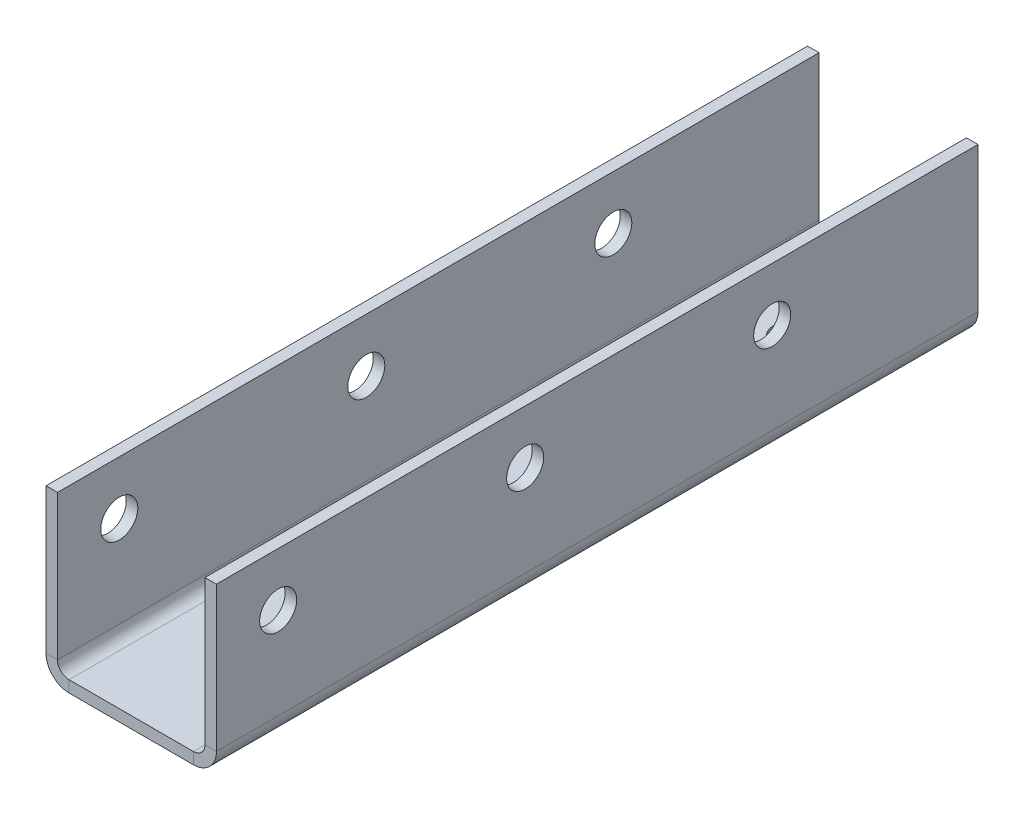
ISO-10303-21;
HEADER;
FILE_DESCRIPTION(('STEP AP214'),'2;1');
FILE_NAME('part.step','',(''),(''),'','','');
FILE_SCHEMA(('AUTOMOTIVE_DESIGN { 1 0 10303 214 1 1 1 1 }'));
ENDSEC;
DATA;
#1=APPLICATION_CONTEXT('core data for automotive mechanical design processes');
#2=APPLICATION_PROTOCOL_DEFINITION('international standard','automotive_design',2000,#1);
#3=PRODUCT_CONTEXT('',#1,'mechanical');
#4=PRODUCT('Part','Part','',(#3));
#5=PRODUCT_RELATED_PRODUCT_CATEGORY('part','',(#4));
#6=PRODUCT_DEFINITION_FORMATION('','',#4);
#7=PRODUCT_DEFINITION_CONTEXT('part definition',#1,'design');
#8=PRODUCT_DEFINITION('design','',#6,#7);
#9=PRODUCT_DEFINITION_SHAPE('','',#8);
#10=(LENGTH_UNIT() NAMED_UNIT(*) SI_UNIT(.MILLI.,.METRE.));
#11=(NAMED_UNIT(*) PLANE_ANGLE_UNIT() SI_UNIT($,.RADIAN.));
#12=(NAMED_UNIT(*) SI_UNIT($,.STERADIAN.) SOLID_ANGLE_UNIT());
#13=UNCERTAINTY_MEASURE_WITH_UNIT(LENGTH_MEASURE(1.E-05),#10,'distance_accuracy_value','');
#14=(GEOMETRIC_REPRESENTATION_CONTEXT(3) GLOBAL_UNCERTAINTY_ASSIGNED_CONTEXT((#13)) GLOBAL_UNIT_ASSIGNED_CONTEXT((#10,
#11,#12)) REPRESENTATION_CONTEXT('',''));
#15=CARTESIAN_POINT('',(0.,0.,0.));
#16=DIRECTION('',(0.,0.,1.));
#17=DIRECTION('',(1.,0.,0.));
#18=AXIS2_PLACEMENT_3D('',#15,#16,#17);
#19=CARTESIAN_POINT('',(15.1,0.,185.));
#20=DIRECTION('',(0.,0.,1.));
#21=DIRECTION('',(1.,0.,0.));
#22=AXIS2_PLACEMENT_3D('',#19,#20,#21);
#23=PLANE('',#22);
#24=DIRECTION('',(0.,1.,0.));
#25=VECTOR('',#24,1.);
#26=CARTESIAN_POINT('',(15.1,0.,185.));
#27=LINE('',#26,#25);
#28=CARTESIAN_POINT('',(15.1,0.,185.));
#29=VERTEX_POINT('',#28);
#30=CARTESIAN_POINT('',(15.1,2.80000000000001,185.));
#31=VERTEX_POINT('',#30);
#32=EDGE_CURVE('E11',#29,#31,#27,.T.);
#33=ORIENTED_EDGE('',*,*,#32,.F.);
#34=CARTESIAN_POINT('',(15.1,5.60000000000001,185.));
#35=DIRECTION('',(0.,0.,1.));
#36=DIRECTION('',(1.,0.,0.));
#37=AXIS2_PLACEMENT_3D('',#34,#35,#36);
#38=CIRCLE('',#37,5.6);
#39=CARTESIAN_POINT('',(20.7,5.60000000000001,185.));
#40=VERTEX_POINT('',#39);
#41=EDGE_CURVE('E278',#40,#29,#38,.F.);
#42=ORIENTED_EDGE('',*,*,#41,.F.);
#43=DIRECTION('',(1.,0.,0.));
#44=VECTOR('',#43,1.);
#45=CARTESIAN_POINT('',(17.9,5.60000000000001,185.));
#46=LINE('',#45,#44);
#47=CARTESIAN_POINT('',(17.9,5.60000000000001,185.));
#48=VERTEX_POINT('',#47);
#49=EDGE_CURVE('E47',#48,#40,#46,.T.);
#50=ORIENTED_EDGE('',*,*,#49,.F.);
#51=CARTESIAN_POINT('',(15.1,5.60000000000001,185.));
#52=DIRECTION('',(0.,0.,1.));
#53=DIRECTION('',(1.,0.,0.));
#54=AXIS2_PLACEMENT_3D('',#51,#52,#53);
#55=CIRCLE('',#54,2.8);
#56=EDGE_CURVE('E149',#48,#31,#55,.F.);
#57=ORIENTED_EDGE('',*,*,#56,.T.);
#58=EDGE_LOOP('',(#33,#42,#50,#57));
#59=FACE_BOUND('',#58,.T.);
#60=ADVANCED_FACE('F38',(#59),#23,.T.);
#61=CARTESIAN_POINT('',(17.9,5.60000000000001,185.));
#62=DIRECTION('',(0.,0.,1.));
#63=DIRECTION('',(1.,0.,0.));
#64=AXIS2_PLACEMENT_3D('',#61,#62,#63);
#65=PLANE('',#64);
#66=DIRECTION('',(-1.,0.,0.));
#67=VECTOR('',#66,1.);
#68=CARTESIAN_POINT('',(-20.7,0.,185.));
#69=LINE('',#68,#67);
#70=CARTESIAN_POINT('',(-15.1,0.,185.));
#71=VERTEX_POINT('',#70);
#72=EDGE_CURVE('E143',#29,#71,#69,.T.);
#73=ORIENTED_EDGE('',*,*,#72,.F.);
#74=ORIENTED_EDGE('',*,*,#32,.T.);
#75=DIRECTION('',(-1.,0.,0.));
#76=VECTOR('',#75,1.);
#77=CARTESIAN_POINT('',(-20.7,2.8,185.));
#78=LINE('',#77,#76);
#79=CARTESIAN_POINT('',(-15.1,2.8,185.));
#80=VERTEX_POINT('',#79);
#81=EDGE_CURVE('E140',#31,#80,#78,.T.);
#82=ORIENTED_EDGE('',*,*,#81,.T.);
#83=DIRECTION('',(0.,-1.,0.));
#84=VECTOR('',#83,1.);
#85=CARTESIAN_POINT('',(-15.1,2.8,185.));
#86=LINE('',#85,#84);
#87=EDGE_CURVE('E232',#80,#71,#86,.T.);
#88=ORIENTED_EDGE('',*,*,#87,.T.);
#89=EDGE_LOOP('',(#73,#74,#82,#88));
#90=FACE_BOUND('',#89,.T.);
#91=ADVANCED_FACE('F138',(#90),#65,.T.);
#92=CARTESIAN_POINT('',(20.7,5.60000000000001,0.));
#93=DIRECTION('',(0.,0.,-1.));
#94=DIRECTION('',(-1.,0.,0.));
#95=AXIS2_PLACEMENT_3D('',#92,#93,#94);
#96=PLANE('',#95);
#97=DIRECTION('',(-1.,0.,0.));
#98=VECTOR('',#97,1.);
#99=CARTESIAN_POINT('',(20.7,5.60000000000001,0.));
#100=LINE('',#99,#98);
#101=CARTESIAN_POINT('',(20.7,5.60000000000001,0.));
#102=VERTEX_POINT('',#101);
#103=CARTESIAN_POINT('',(17.9,5.60000000000001,0.));
#104=VERTEX_POINT('',#103);
#105=EDGE_CURVE('E237',#102,#104,#100,.T.);
#106=ORIENTED_EDGE('',*,*,#105,.F.);
#107=CARTESIAN_POINT('',(15.1,5.60000000000001,0.));
#108=DIRECTION('',(0.,0.,1.));
#109=DIRECTION('',(1.,0.,0.));
#110=AXIS2_PLACEMENT_3D('',#107,#108,#109);
#111=CIRCLE('',#110,5.6);
#112=CARTESIAN_POINT('',(15.1,0.,0.));
#113=VERTEX_POINT('',#112);
#114=EDGE_CURVE('E189',#102,#113,#111,.F.);
#115=ORIENTED_EDGE('',*,*,#114,.T.);
#116=DIRECTION('',(0.,-1.,0.));
#117=VECTOR('',#116,1.);
#118=CARTESIAN_POINT('',(15.1,2.80000000000001,0.));
#119=LINE('',#118,#117);
#120=CARTESIAN_POINT('',(15.1,2.80000000000001,0.));
#121=VERTEX_POINT('',#120);
#122=EDGE_CURVE('E235',#121,#113,#119,.T.);
#123=ORIENTED_EDGE('',*,*,#122,.F.);
#124=CARTESIAN_POINT('',(15.1,5.60000000000001,0.));
#125=DIRECTION('',(0.,0.,1.));
#126=DIRECTION('',(1.,0.,0.));
#127=AXIS2_PLACEMENT_3D('',#124,#125,#126);
#128=CIRCLE('',#127,2.8);
#129=EDGE_CURVE('E161',#104,#121,#128,.F.);
#130=ORIENTED_EDGE('',*,*,#129,.F.);
#131=EDGE_LOOP('',(#106,#115,#123,#130));
#132=FACE_BOUND('',#131,.T.);
#133=ADVANCED_FACE('F296',(#132),#96,.T.);
#134=CARTESIAN_POINT('',(15.1,2.80000000000001,0.));
#135=DIRECTION('',(0.,0.,-1.));
#136=DIRECTION('',(-1.,0.,0.));
#137=AXIS2_PLACEMENT_3D('',#134,#135,#136);
#138=PLANE('',#137);
#139=DIRECTION('',(0.,-1.,0.));
#140=VECTOR('',#139,1.);
#141=CARTESIAN_POINT('',(20.7,0.,0.));
#142=LINE('',#141,#140);
#143=CARTESIAN_POINT('',(20.7,40.8,0.));
#144=VERTEX_POINT('',#143);
#145=EDGE_CURVE('E192',#144,#102,#142,.T.);
#146=ORIENTED_EDGE('',*,*,#145,.T.);
#147=ORIENTED_EDGE('',*,*,#105,.T.);
#148=DIRECTION('',(0.,1.,0.));
#149=VECTOR('',#148,1.);
#150=CARTESIAN_POINT('',(17.9,0.,0.));
#151=LINE('',#150,#149);
#152=CARTESIAN_POINT('',(17.9,40.8,0.));
#153=VERTEX_POINT('',#152);
#154=EDGE_CURVE('E198',#153,#104,#151,.F.);
#155=ORIENTED_EDGE('',*,*,#154,.F.);
#156=DIRECTION('',(1.,0.,0.));
#157=VECTOR('',#156,1.);
#158=CARTESIAN_POINT('',(17.9,40.8,0.));
#159=LINE('',#158,#157);
#160=EDGE_CURVE('E195',#153,#144,#159,.T.);
#161=ORIENTED_EDGE('',*,*,#160,.T.);
#162=EDGE_LOOP('',(#146,#147,#155,#161));
#163=FACE_BOUND('',#162,.T.);
#164=ADVANCED_FACE('F344',(#163),#138,.T.);
#165=CARTESIAN_POINT('',(-20.7,5.6,185.));
#166=DIRECTION('',(0.,0.,1.));
#167=DIRECTION('',(1.,0.,0.));
#168=AXIS2_PLACEMENT_3D('',#165,#166,#167);
#169=PLANE('',#168);
#170=DIRECTION('',(1.,0.,0.));
#171=VECTOR('',#170,1.);
#172=CARTESIAN_POINT('',(-20.7,5.6,185.));
#173=LINE('',#172,#171);
#174=CARTESIAN_POINT('',(-20.7,5.6,185.));
#175=VERTEX_POINT('',#174);
#176=CARTESIAN_POINT('',(-17.9,5.6,185.));
#177=VERTEX_POINT('',#176);
#178=EDGE_CURVE('E56',#175,#177,#173,.T.);
#179=ORIENTED_EDGE('',*,*,#178,.F.);
#180=CARTESIAN_POINT('',(-15.1,5.6,185.));
#181=DIRECTION('',(0.,0.,1.));
#182=DIRECTION('',(1.,0.,0.));
#183=AXIS2_PLACEMENT_3D('',#180,#181,#182);
#184=CIRCLE('',#183,5.6);
#185=EDGE_CURVE('E274',#71,#175,#184,.F.);
#186=ORIENTED_EDGE('',*,*,#185,.F.);
#187=ORIENTED_EDGE('',*,*,#87,.F.);
#188=CARTESIAN_POINT('',(-15.1,5.6,185.));
#189=DIRECTION('',(0.,0.,1.));
#190=DIRECTION('',(1.,0.,0.));
#191=AXIS2_PLACEMENT_3D('',#188,#189,#190);
#192=CIRCLE('',#191,2.8);
#193=EDGE_CURVE('E169',#80,#177,#192,.F.);
#194=ORIENTED_EDGE('',*,*,#193,.T.);
#195=EDGE_LOOP('',(#179,#186,#187,#194));
#196=FACE_BOUND('',#195,.T.);
#197=ADVANCED_FACE('F349',(#196),#169,.T.);
#198=CARTESIAN_POINT('',(-15.1,2.8,185.));
#199=DIRECTION('',(0.,0.,1.));
#200=DIRECTION('',(1.,0.,0.));
#201=AXIS2_PLACEMENT_3D('',#198,#199,#200);
#202=PLANE('',#201);
#203=DIRECTION('',(0.,1.,0.));
#204=VECTOR('',#203,1.);
#205=CARTESIAN_POINT('',(-20.7,0.,185.));
#206=LINE('',#205,#204);
#207=CARTESIAN_POINT('',(-20.7,40.8,185.));
#208=VERTEX_POINT('',#207);
#209=EDGE_CURVE('E271',#175,#208,#206,.T.);
#210=ORIENTED_EDGE('',*,*,#209,.F.);
#211=ORIENTED_EDGE('',*,*,#178,.T.);
#212=DIRECTION('',(0.,1.,0.));
#213=VECTOR('',#212,1.);
#214=CARTESIAN_POINT('',(-17.9,0.,185.));
#215=LINE('',#214,#213);
#216=CARTESIAN_POINT('',(-17.9,40.8,185.));
#217=VERTEX_POINT('',#216);
#218=EDGE_CURVE('E110',#177,#217,#215,.T.);
#219=ORIENTED_EDGE('',*,*,#218,.T.);
#220=DIRECTION('',(1.,0.,0.));
#221=VECTOR('',#220,1.);
#222=CARTESIAN_POINT('',(-20.7,40.8,185.));
#223=LINE('',#222,#221);
#224=EDGE_CURVE('E268',#208,#217,#223,.T.);
#225=ORIENTED_EDGE('',*,*,#224,.F.);
#226=EDGE_LOOP('',(#210,#211,#219,#225));
#227=FACE_BOUND('',#226,.T.);
#228=ADVANCED_FACE('F323',(#227),#202,.T.);
#229=CARTESIAN_POINT('',(-15.1,0.,0.));
#230=DIRECTION('',(0.,0.,-1.));
#231=DIRECTION('',(-1.,0.,0.));
#232=AXIS2_PLACEMENT_3D('',#229,#230,#231);
#233=PLANE('',#232);
#234=DIRECTION('',(0.,1.,0.));
#235=VECTOR('',#234,1.);
#236=CARTESIAN_POINT('',(-15.1,0.,0.));
#237=LINE('',#236,#235);
#238=CARTESIAN_POINT('',(-15.1,0.,0.));
#239=VERTEX_POINT('',#238);
#240=CARTESIAN_POINT('',(-15.1,2.8,0.));
#241=VERTEX_POINT('',#240);
#242=EDGE_CURVE('E97',#239,#241,#237,.T.);
#243=ORIENTED_EDGE('',*,*,#242,.F.);
#244=CARTESIAN_POINT('',(-15.1,5.6,0.));
#245=DIRECTION('',(0.,0.,1.));
#246=DIRECTION('',(1.,0.,0.));
#247=AXIS2_PLACEMENT_3D('',#244,#245,#246);
#248=CIRCLE('',#247,5.6);
#249=CARTESIAN_POINT('',(-20.7,5.6,0.));
#250=VERTEX_POINT('',#249);
#251=EDGE_CURVE('E185',#239,#250,#248,.F.);
#252=ORIENTED_EDGE('',*,*,#251,.T.);
#253=DIRECTION('',(-1.,0.,0.));
#254=VECTOR('',#253,1.);
#255=CARTESIAN_POINT('',(-17.9,5.6,0.));
#256=LINE('',#255,#254);
#257=CARTESIAN_POINT('',(-17.9,5.6,0.));
#258=VERTEX_POINT('',#257);
#259=EDGE_CURVE('E104',#258,#250,#256,.T.);
#260=ORIENTED_EDGE('',*,*,#259,.F.);
#261=CARTESIAN_POINT('',(-15.1,5.6,0.));
#262=DIRECTION('',(0.,0.,1.));
#263=DIRECTION('',(1.,0.,0.));
#264=AXIS2_PLACEMENT_3D('',#261,#262,#263);
#265=CIRCLE('',#264,2.8);
#266=EDGE_CURVE('E204',#241,#258,#265,.F.);
#267=ORIENTED_EDGE('',*,*,#266,.F.);
#268=EDGE_LOOP('',(#243,#252,#260,#267));
#269=FACE_BOUND('',#268,.T.);
#270=ADVANCED_FACE('F311',(#269),#233,.T.);
#271=CARTESIAN_POINT('',(-17.9,5.6,0.));
#272=DIRECTION('',(0.,0.,-1.));
#273=DIRECTION('',(-1.,0.,0.));
#274=AXIS2_PLACEMENT_3D('',#271,#272,#273);
#275=PLANE('',#274);
#276=DIRECTION('',(-1.,0.,0.));
#277=VECTOR('',#276,1.);
#278=CARTESIAN_POINT('',(-20.7,0.,0.));
#279=LINE('',#278,#277);
#280=EDGE_CURVE('E187',#113,#239,#279,.T.);
#281=ORIENTED_EDGE('',*,*,#280,.T.);
#282=ORIENTED_EDGE('',*,*,#242,.T.);
#283=DIRECTION('',(-1.,0.,0.));
#284=VECTOR('',#283,1.);
#285=CARTESIAN_POINT('',(-20.7,2.8,0.));
#286=LINE('',#285,#284);
#287=EDGE_CURVE('E202',#121,#241,#286,.T.);
#288=ORIENTED_EDGE('',*,*,#287,.F.);
#289=ORIENTED_EDGE('',*,*,#122,.T.);
#290=EDGE_LOOP('',(#281,#282,#288,#289));
#291=FACE_BOUND('',#290,.T.);
#292=ADVANCED_FACE('F298',(#291),#275,.T.);
#293=CARTESIAN_POINT('',(-17.9,0.,185.));
#294=DIRECTION('',(-1.,0.,0.));
#295=DIRECTION('',(0.,0.,1.));
#296=AXIS2_PLACEMENT_3D('',#293,#294,#295);
#297=PLANE('',#296);
#298=CARTESIAN_POINT('',(-17.9,27.8,50.));
#299=DIRECTION('',(-1.,0.,0.));
#300=DIRECTION('',(0.,0.,1.));
#301=AXIS2_PLACEMENT_3D('',#298,#299,#300);
#302=CIRCLE('',#301,4.5);
#303=CARTESIAN_POINT('',(-17.9,27.8,54.5));
#304=VERTEX_POINT('',#303);
#305=EDGE_CURVE('E259',#304,#304,#302,.T.);
#306=ORIENTED_EDGE('',*,*,#305,.T.);
#307=EDGE_LOOP('',(#306));
#308=FACE_BOUND('',#307,.T.);
#309=CARTESIAN_POINT('',(-17.9,27.8,110.));
#310=DIRECTION('',(-1.,0.,0.));
#311=DIRECTION('',(0.,0.,1.));
#312=AXIS2_PLACEMENT_3D('',#309,#310,#311);
#313=CIRCLE('',#312,4.5);
#314=CARTESIAN_POINT('',(-17.9,27.8,114.5));
#315=VERTEX_POINT('',#314);
#316=EDGE_CURVE('E246',#315,#315,#313,.T.);
#317=ORIENTED_EDGE('',*,*,#316,.T.);
#318=EDGE_LOOP('',(#317));
#319=FACE_BOUND('',#318,.T.);
#320=CARTESIAN_POINT('',(-17.9,27.8,170.));
#321=DIRECTION('',(-1.,0.,0.));
#322=DIRECTION('',(0.,0.,1.));
#323=AXIS2_PLACEMENT_3D('',#320,#321,#322);
#324=CIRCLE('',#323,4.49999999999999);
#325=CARTESIAN_POINT('',(-17.9,27.8,174.5));
#326=VERTEX_POINT('',#325);
#327=EDGE_CURVE('E242',#326,#326,#324,.T.);
#328=ORIENTED_EDGE('',*,*,#327,.T.);
#329=EDGE_LOOP('',(#328));
#330=FACE_BOUND('',#329,.T.);
#331=DIRECTION('',(0.,1.,0.));
#332=VECTOR('',#331,1.);
#333=CARTESIAN_POINT('',(-17.9,0.,0.));
#334=LINE('',#333,#332);
#335=CARTESIAN_POINT('',(-17.9,40.8,0.));
#336=VERTEX_POINT('',#335);
#337=EDGE_CURVE('E175',#258,#336,#334,.T.);
#338=ORIENTED_EDGE('',*,*,#337,.T.);
#339=DIRECTION('',(0.,0.,-1.));
#340=VECTOR('',#339,1.);
#341=CARTESIAN_POINT('',(-17.9,40.8,185.));
#342=LINE('',#341,#340);
#343=EDGE_CURVE('E228',#217,#336,#342,.T.);
#344=ORIENTED_EDGE('',*,*,#343,.F.);
#345=ORIENTED_EDGE('',*,*,#218,.F.);
#346=DIRECTION('',(0.,0.,-1.));
#347=VECTOR('',#346,1.);
#348=CARTESIAN_POINT('',(-17.9,5.6,185.));
#349=LINE('',#348,#347);
#350=EDGE_CURVE('E171',#177,#258,#349,.T.);
#351=ORIENTED_EDGE('',*,*,#350,.T.);
#352=EDGE_LOOP('',(#338,#344,#345,#351));
#353=FACE_BOUND('',#352,.T.);
#354=ADVANCED_FACE('F317',(#308,#319,#330,#353),#297,.F.);
#355=CARTESIAN_POINT('',(-20.7,40.8,185.));
#356=DIRECTION('',(0.,1.,0.));
#357=DIRECTION('',(0.,0.,1.));
#358=AXIS2_PLACEMENT_3D('',#355,#356,#357);
#359=PLANE('',#358);
#360=DIRECTION('',(1.,0.,0.));
#361=VECTOR('',#360,1.);
#362=CARTESIAN_POINT('',(-20.7,40.8,0.));
#363=LINE('',#362,#361);
#364=CARTESIAN_POINT('',(-20.7,40.8,0.));
#365=VERTEX_POINT('',#364);
#366=EDGE_CURVE('E178',#365,#336,#363,.T.);
#367=ORIENTED_EDGE('',*,*,#366,.F.);
#368=DIRECTION('',(0.,0.,-1.));
#369=VECTOR('',#368,1.);
#370=CARTESIAN_POINT('',(-20.7,40.8,185.));
#371=LINE('',#370,#369);
#372=EDGE_CURVE('E226',#208,#365,#371,.T.);
#373=ORIENTED_EDGE('',*,*,#372,.F.);
#374=ORIENTED_EDGE('',*,*,#224,.T.);
#375=ORIENTED_EDGE('',*,*,#343,.T.);
#376=EDGE_LOOP('',(#367,#373,#374,#375));
#377=FACE_BOUND('',#376,.T.);
#378=ADVANCED_FACE('F322',(#377),#359,.T.);
#379=CARTESIAN_POINT('',(-20.7,0.,185.));
#380=DIRECTION('',(-1.,0.,0.));
#381=DIRECTION('',(0.,0.,1.));
#382=AXIS2_PLACEMENT_3D('',#379,#380,#381);
#383=PLANE('',#382);
#384=CARTESIAN_POINT('',(-20.7,27.8,50.));
#385=DIRECTION('',(-1.,0.,0.));
#386=DIRECTION('',(0.,0.,1.));
#387=AXIS2_PLACEMENT_3D('',#384,#385,#386);
#388=CIRCLE('',#387,4.5);
#389=CARTESIAN_POINT('',(-20.7,27.8,54.5));
#390=VERTEX_POINT('',#389);
#391=EDGE_CURVE('E400',#390,#390,#388,.T.);
#392=ORIENTED_EDGE('',*,*,#391,.F.);
#393=EDGE_LOOP('',(#392));
#394=FACE_BOUND('',#393,.T.);
#395=CARTESIAN_POINT('',(-20.7,27.8,110.));
#396=DIRECTION('',(-1.,0.,0.));
#397=DIRECTION('',(0.,0.,1.));
#398=AXIS2_PLACEMENT_3D('',#395,#396,#397);
#399=CIRCLE('',#398,4.5);
#400=CARTESIAN_POINT('',(-20.7,27.8,114.5));
#401=VERTEX_POINT('',#400);
#402=EDGE_CURVE('E401',#401,#401,#399,.T.);
#403=ORIENTED_EDGE('',*,*,#402,.F.);
#404=EDGE_LOOP('',(#403));
#405=FACE_BOUND('',#404,.T.);
#406=CARTESIAN_POINT('',(-20.7,27.8,170.));
#407=DIRECTION('',(-1.,0.,0.));
#408=DIRECTION('',(0.,0.,1.));
#409=AXIS2_PLACEMENT_3D('',#406,#407,#408);
#410=CIRCLE('',#409,4.49999999999999);
#411=CARTESIAN_POINT('',(-20.7,27.8,174.5));
#412=VERTEX_POINT('',#411);
#413=EDGE_CURVE('E407',#412,#412,#410,.T.);
#414=ORIENTED_EDGE('',*,*,#413,.F.);
#415=EDGE_LOOP('',(#414));
#416=FACE_BOUND('',#415,.T.);
#417=DIRECTION('',(0.,1.,0.));
#418=VECTOR('',#417,1.);
#419=CARTESIAN_POINT('',(-20.7,0.,0.));
#420=LINE('',#419,#418);
#421=EDGE_CURVE('E182',#250,#365,#420,.T.);
#422=ORIENTED_EDGE('',*,*,#421,.F.);
#423=DIRECTION('',(0.,0.,-1.));
#424=VECTOR('',#423,1.);
#425=CARTESIAN_POINT('',(-20.7,5.6,185.));
#426=LINE('',#425,#424);
#427=EDGE_CURVE('E223',#175,#250,#426,.T.);
#428=ORIENTED_EDGE('',*,*,#427,.F.);
#429=ORIENTED_EDGE('',*,*,#209,.T.);
#430=ORIENTED_EDGE('',*,*,#372,.T.);
#431=EDGE_LOOP('',(#422,#428,#429,#430));
#432=FACE_BOUND('',#431,.T.);
#433=ADVANCED_FACE('F325',(#394,#405,#416,#432),#383,.T.);
#434=CARTESIAN_POINT('',(-15.1,5.6,185.));
#435=DIRECTION('',(0.,0.,-1.));
#436=DIRECTION('',(-1.,0.,0.));
#437=AXIS2_PLACEMENT_3D('',#434,#435,#436);
#438=CYLINDRICAL_SURFACE('',#437,5.6);
#439=ORIENTED_EDGE('',*,*,#251,.F.);
#440=DIRECTION('',(0.,0.,-1.));
#441=VECTOR('',#440,1.);
#442=CARTESIAN_POINT('',(-15.1,0.,185.));
#443=LINE('',#442,#441);
#444=EDGE_CURVE('E220',#71,#239,#443,.T.);
#445=ORIENTED_EDGE('',*,*,#444,.F.);
#446=ORIENTED_EDGE('',*,*,#185,.T.);
#447=ORIENTED_EDGE('',*,*,#427,.T.);
#448=EDGE_LOOP('',(#439,#445,#446,#447));
#449=FACE_BOUND('',#448,.T.);
#450=ADVANCED_FACE('F308',(#449),#438,.T.);
#451=CARTESIAN_POINT('',(-20.7,0.,185.));
#452=DIRECTION('',(0.,-1.,0.));
#453=DIRECTION('',(1.,0.,0.));
#454=AXIS2_PLACEMENT_3D('',#451,#452,#453);
#455=PLANE('',#454);
#456=CARTESIAN_POINT('',(0.,0.,25.));
#457=DIRECTION('',(0.,-1.,0.));
#458=DIRECTION('',(1.,0.,0.));
#459=AXIS2_PLACEMENT_3D('',#456,#457,#458);
#460=CIRCLE('',#459,4.);
#461=CARTESIAN_POINT('',(4.,0.,25.));
#462=VERTEX_POINT('',#461);
#463=EDGE_CURVE('E262',#462,#462,#460,.T.);
#464=ORIENTED_EDGE('',*,*,#463,.F.);
#465=EDGE_LOOP('',(#464));
#466=FACE_BOUND('',#465,.T.);
#467=ORIENTED_EDGE('',*,*,#280,.F.);
#468=DIRECTION('',(0.,0.,-1.));
#469=VECTOR('',#468,1.);
#470=CARTESIAN_POINT('',(15.1,0.,185.));
#471=LINE('',#470,#469);
#472=EDGE_CURVE('E217',#29,#113,#471,.T.);
#473=ORIENTED_EDGE('',*,*,#472,.F.);
#474=ORIENTED_EDGE('',*,*,#72,.T.);
#475=ORIENTED_EDGE('',*,*,#444,.T.);
#476=EDGE_LOOP('',(#467,#473,#474,#475));
#477=FACE_BOUND('',#476,.T.);
#478=ADVANCED_FACE('F303',(#466,#477),#455,.T.);
#479=CARTESIAN_POINT('',(15.1,5.60000000000001,185.));
#480=DIRECTION('',(0.,0.,-1.));
#481=DIRECTION('',(-1.,0.,0.));
#482=AXIS2_PLACEMENT_3D('',#479,#480,#481);
#483=CYLINDRICAL_SURFACE('',#482,5.6);
#484=ORIENTED_EDGE('',*,*,#114,.F.);
#485=DIRECTION('',(0.,0.,-1.));
#486=VECTOR('',#485,1.);
#487=CARTESIAN_POINT('',(20.7,5.60000000000001,185.));
#488=LINE('',#487,#486);
#489=EDGE_CURVE('E214',#40,#102,#488,.T.);
#490=ORIENTED_EDGE('',*,*,#489,.F.);
#491=ORIENTED_EDGE('',*,*,#41,.T.);
#492=ORIENTED_EDGE('',*,*,#472,.T.);
#493=EDGE_LOOP('',(#484,#490,#491,#492));
#494=FACE_BOUND('',#493,.T.);
#495=ADVANCED_FACE('F301',(#494),#483,.T.);
#496=CARTESIAN_POINT('',(20.7,0.,185.));
#497=DIRECTION('',(1.,0.,0.));
#498=DIRECTION('',(0.,0.,-1.));
#499=AXIS2_PLACEMENT_3D('',#496,#497,#498);
#500=PLANE('',#499);
#501=CARTESIAN_POINT('',(20.7,27.8,50.));
#502=DIRECTION('',(1.,0.,0.));
#503=DIRECTION('',(0.,0.,-1.));
#504=AXIS2_PLACEMENT_3D('',#501,#502,#503);
#505=CIRCLE('',#504,4.5);
#506=CARTESIAN_POINT('',(20.7,27.8,45.5));
#507=VERTEX_POINT('',#506);
#508=EDGE_CURVE('E243',#507,#507,#505,.F.);
#509=ORIENTED_EDGE('',*,*,#508,.T.);
#510=EDGE_LOOP('',(#509));
#511=FACE_BOUND('',#510,.T.);
#512=CARTESIAN_POINT('',(20.7,27.8,110.));
#513=DIRECTION('',(1.,0.,0.));
#514=DIRECTION('',(0.,0.,-1.));
#515=AXIS2_PLACEMENT_3D('',#512,#513,#514);
#516=CIRCLE('',#515,4.5);
#517=CARTESIAN_POINT('',(20.7,27.8,105.5));
#518=VERTEX_POINT('',#517);
#519=EDGE_CURVE('E398',#518,#518,#516,.F.);
#520=ORIENTED_EDGE('',*,*,#519,.T.);
#521=EDGE_LOOP('',(#520));
#522=FACE_BOUND('',#521,.T.);
#523=CARTESIAN_POINT('',(20.7,27.8,170.));
#524=DIRECTION('',(1.,0.,0.));
#525=DIRECTION('',(0.,0.,-1.));
#526=AXIS2_PLACEMENT_3D('',#523,#524,#525);
#527=CIRCLE('',#526,4.49999999999999);
#528=CARTESIAN_POINT('',(20.7,27.8,165.5));
#529=VERTEX_POINT('',#528);
#530=EDGE_CURVE('E256',#529,#529,#527,.F.);
#531=ORIENTED_EDGE('',*,*,#530,.T.);
#532=EDGE_LOOP('',(#531));
#533=FACE_BOUND('',#532,.T.);
#534=ORIENTED_EDGE('',*,*,#145,.F.);
#535=DIRECTION('',(0.,0.,-1.));
#536=VECTOR('',#535,1.);
#537=CARTESIAN_POINT('',(20.7,40.8,185.));
#538=LINE('',#537,#536);
#539=CARTESIAN_POINT('',(20.7,40.8,185.));
#540=VERTEX_POINT('',#539);
#541=EDGE_CURVE('E212',#540,#144,#538,.T.);
#542=ORIENTED_EDGE('',*,*,#541,.F.);
#543=DIRECTION('',(0.,-1.,0.));
#544=VECTOR('',#543,1.);
#545=CARTESIAN_POINT('',(20.7,0.,185.));
#546=LINE('',#545,#544);
#547=EDGE_CURVE('E280',#540,#40,#546,.T.);
#548=ORIENTED_EDGE('',*,*,#547,.T.);
#549=ORIENTED_EDGE('',*,*,#489,.T.);
#550=EDGE_LOOP('',(#534,#542,#548,#549));
#551=FACE_BOUND('',#550,.T.);
#552=ADVANCED_FACE('F413',(#511,#522,#533,#551),#500,.T.);
#553=CARTESIAN_POINT('',(17.9,40.8,185.));
#554=DIRECTION('',(0.,1.,0.));
#555=DIRECTION('',(0.,0.,1.));
#556=AXIS2_PLACEMENT_3D('',#553,#554,#555);
#557=PLANE('',#556);
#558=ORIENTED_EDGE('',*,*,#160,.F.);
#559=DIRECTION('',(0.,0.,-1.));
#560=VECTOR('',#559,1.);
#561=CARTESIAN_POINT('',(17.9,40.8,185.));
#562=LINE('',#561,#560);
#563=CARTESIAN_POINT('',(17.9,40.8,185.));
#564=VERTEX_POINT('',#563);
#565=EDGE_CURVE('E210',#564,#153,#562,.T.);
#566=ORIENTED_EDGE('',*,*,#565,.F.);
#567=DIRECTION('',(1.,0.,0.));
#568=VECTOR('',#567,1.);
#569=CARTESIAN_POINT('',(17.9,40.8,185.));
#570=LINE('',#569,#568);
#571=EDGE_CURVE('E283',#564,#540,#570,.T.);
#572=ORIENTED_EDGE('',*,*,#571,.T.);
#573=ORIENTED_EDGE('',*,*,#541,.T.);
#574=EDGE_LOOP('',(#558,#566,#572,#573));
#575=FACE_BOUND('',#574,.T.);
#576=ADVANCED_FACE('F419',(#575),#557,.T.);
#577=CARTESIAN_POINT('',(17.9,0.,185.));
#578=DIRECTION('',(1.,0.,0.));
#579=DIRECTION('',(0.,0.,-1.));
#580=AXIS2_PLACEMENT_3D('',#577,#578,#579);
#581=PLANE('',#580);
#582=CARTESIAN_POINT('',(17.9,27.8,50.));
#583=DIRECTION('',(1.,0.,0.));
#584=DIRECTION('',(0.,0.,-1.));
#585=AXIS2_PLACEMENT_3D('',#582,#583,#584);
#586=CIRCLE('',#585,4.5);
#587=CARTESIAN_POINT('',(17.9,27.8,45.5));
#588=VERTEX_POINT('',#587);
#589=EDGE_CURVE('E41',#588,#588,#586,.T.);
#590=ORIENTED_EDGE('',*,*,#589,.T.);
#591=EDGE_LOOP('',(#590));
#592=FACE_BOUND('',#591,.T.);
#593=CARTESIAN_POINT('',(17.9,27.8,110.));
#594=DIRECTION('',(1.,0.,0.));
#595=DIRECTION('',(0.,0.,-1.));
#596=AXIS2_PLACEMENT_3D('',#593,#594,#595);
#597=CIRCLE('',#596,4.5);
#598=CARTESIAN_POINT('',(17.9,27.8,105.5));
#599=VERTEX_POINT('',#598);
#600=EDGE_CURVE('E244',#599,#599,#597,.T.);
#601=ORIENTED_EDGE('',*,*,#600,.T.);
#602=EDGE_LOOP('',(#601));
#603=FACE_BOUND('',#602,.T.);
#604=CARTESIAN_POINT('',(17.9,27.8,170.));
#605=DIRECTION('',(1.,0.,0.));
#606=DIRECTION('',(0.,0.,-1.));
#607=AXIS2_PLACEMENT_3D('',#604,#605,#606);
#608=CIRCLE('',#607,4.49999999999999);
#609=CARTESIAN_POINT('',(17.9,27.8,165.5));
#610=VERTEX_POINT('',#609);
#611=EDGE_CURVE('E240',#610,#610,#608,.T.);
#612=ORIENTED_EDGE('',*,*,#611,.T.);
#613=EDGE_LOOP('',(#612));
#614=FACE_BOUND('',#613,.T.);
#615=ORIENTED_EDGE('',*,*,#154,.T.);
#616=DIRECTION('',(0.,0.,-1.));
#617=VECTOR('',#616,1.);
#618=CARTESIAN_POINT('',(17.9,5.60000000000001,185.));
#619=LINE('',#618,#617);
#620=EDGE_CURVE('E163',#48,#104,#619,.T.);
#621=ORIENTED_EDGE('',*,*,#620,.F.);
#622=DIRECTION('',(0.,1.,0.));
#623=VECTOR('',#622,1.);
#624=CARTESIAN_POINT('',(17.9,0.,185.));
#625=LINE('',#624,#623);
#626=EDGE_CURVE('E154',#564,#48,#625,.F.);
#627=ORIENTED_EDGE('',*,*,#626,.F.);
#628=ORIENTED_EDGE('',*,*,#565,.T.);
#629=EDGE_LOOP('',(#615,#621,#627,#628));
#630=FACE_BOUND('',#629,.T.);
#631=ADVANCED_FACE('F293',(#592,#603,#614,#630),#581,.F.);
#632=CARTESIAN_POINT('',(15.1,5.60000000000001,185.));
#633=DIRECTION('',(0.,0.,-1.));
#634=DIRECTION('',(-1.,0.,0.));
#635=AXIS2_PLACEMENT_3D('',#632,#633,#634);
#636=CYLINDRICAL_SURFACE('',#635,2.8);
#637=ORIENTED_EDGE('',*,*,#129,.T.);
#638=DIRECTION('',(0.,0.,-1.));
#639=VECTOR('',#638,1.);
#640=CARTESIAN_POINT('',(15.1,2.80000000000001,185.));
#641=LINE('',#640,#639);
#642=EDGE_CURVE('E158',#31,#121,#641,.T.);
#643=ORIENTED_EDGE('',*,*,#642,.F.);
#644=ORIENTED_EDGE('',*,*,#56,.F.);
#645=ORIENTED_EDGE('',*,*,#620,.T.);
#646=EDGE_LOOP('',(#637,#643,#644,#645));
#647=FACE_BOUND('',#646,.T.);
#648=ADVANCED_FACE('F159',(#647),#636,.F.);
#649=CARTESIAN_POINT('',(-20.7,2.8,185.));
#650=DIRECTION('',(0.,-1.,0.));
#651=DIRECTION('',(1.,0.,0.));
#652=AXIS2_PLACEMENT_3D('',#649,#650,#651);
#653=PLANE('',#652);
#654=CARTESIAN_POINT('',(0.,2.8,25.));
#655=DIRECTION('',(0.,-1.,0.));
#656=DIRECTION('',(1.,0.,0.));
#657=AXIS2_PLACEMENT_3D('',#654,#655,#656);
#658=CIRCLE('',#657,4.);
#659=CARTESIAN_POINT('',(4.,2.8,25.));
#660=VERTEX_POINT('',#659);
#661=EDGE_CURVE('E179',#660,#660,#658,.F.);
#662=ORIENTED_EDGE('',*,*,#661,.F.);
#663=EDGE_LOOP('',(#662));
#664=FACE_BOUND('',#663,.T.);
#665=ORIENTED_EDGE('',*,*,#287,.T.);
#666=DIRECTION('',(0.,0.,-1.));
#667=VECTOR('',#666,1.);
#668=CARTESIAN_POINT('',(-15.1,2.8,185.));
#669=LINE('',#668,#667);
#670=EDGE_CURVE('E164',#80,#241,#669,.T.);
#671=ORIENTED_EDGE('',*,*,#670,.F.);
#672=ORIENTED_EDGE('',*,*,#81,.F.);
#673=ORIENTED_EDGE('',*,*,#642,.T.);
#674=EDGE_LOOP('',(#665,#671,#672,#673));
#675=FACE_BOUND('',#674,.T.);
#676=ADVANCED_FACE('F166',(#664,#675),#653,.F.);
#677=CARTESIAN_POINT('',(-15.1,5.6,185.));
#678=DIRECTION('',(0.,0.,-1.));
#679=DIRECTION('',(-1.,0.,0.));
#680=AXIS2_PLACEMENT_3D('',#677,#678,#679);
#681=CYLINDRICAL_SURFACE('',#680,2.8);
#682=ORIENTED_EDGE('',*,*,#266,.T.);
#683=ORIENTED_EDGE('',*,*,#350,.F.);
#684=ORIENTED_EDGE('',*,*,#193,.F.);
#685=ORIENTED_EDGE('',*,*,#670,.T.);
#686=EDGE_LOOP('',(#682,#683,#684,#685));
#687=FACE_BOUND('',#686,.T.);
#688=ADVANCED_FACE('F314',(#687),#681,.F.);
#689=CARTESIAN_POINT('',(-15.1,5.6,185.));
#690=DIRECTION('',(0.,0.,1.));
#691=DIRECTION('',(1.,0.,0.));
#692=AXIS2_PLACEMENT_3D('',#689,#690,#691);
#693=PLANE('',#692);
#694=ORIENTED_EDGE('',*,*,#626,.T.);
#695=ORIENTED_EDGE('',*,*,#49,.T.);
#696=ORIENTED_EDGE('',*,*,#547,.F.);
#697=ORIENTED_EDGE('',*,*,#571,.F.);
#698=EDGE_LOOP('',(#694,#695,#696,#697));
#699=FACE_BOUND('',#698,.T.);
#700=ADVANCED_FACE('F289',(#699),#693,.T.);
#701=CARTESIAN_POINT('',(-15.1,5.6,0.));
#702=DIRECTION('',(0.,0.,1.));
#703=DIRECTION('',(1.,0.,0.));
#704=AXIS2_PLACEMENT_3D('',#701,#702,#703);
#705=PLANE('',#704);
#706=ORIENTED_EDGE('',*,*,#337,.F.);
#707=ORIENTED_EDGE('',*,*,#259,.T.);
#708=ORIENTED_EDGE('',*,*,#421,.T.);
#709=ORIENTED_EDGE('',*,*,#366,.T.);
#710=EDGE_LOOP('',(#706,#707,#708,#709));
#711=FACE_BOUND('',#710,.T.);
#712=ADVANCED_FACE('F319',(#711),#705,.F.);
#713=CARTESIAN_POINT('',(0.,40.801,25.));
#714=DIRECTION('',(0.,-1.,0.));
#715=DIRECTION('',(1.,0.,0.));
#716=AXIS2_PLACEMENT_3D('',#713,#714,#715);
#717=CYLINDRICAL_SURFACE('',#716,4.);
#718=ORIENTED_EDGE('',*,*,#463,.T.);
#719=EDGE_LOOP('',(#718));
#720=FACE_BOUND('',#719,.T.);
#721=ORIENTED_EDGE('',*,*,#661,.T.);
#722=EDGE_LOOP('',(#721));
#723=FACE_BOUND('',#722,.T.);
#724=ADVANCED_FACE('F393',(#720,#723),#717,.F.);
#725=CARTESIAN_POINT('',(33.4279220613579,27.8,170.));
#726=DIRECTION('',(-1.,0.,0.));
#727=DIRECTION('',(0.,0.,1.));
#728=AXIS2_PLACEMENT_3D('',#725,#726,#727);
#729=CYLINDRICAL_SURFACE('',#728,4.49999999999999);
#730=ORIENTED_EDGE('',*,*,#530,.F.);
#731=EDGE_LOOP('',(#730));
#732=FACE_BOUND('',#731,.T.);
#733=ORIENTED_EDGE('',*,*,#611,.F.);
#734=EDGE_LOOP('',(#733));
#735=FACE_BOUND('',#734,.T.);
#736=ADVANCED_FACE('F384',(#732,#735),#729,.F.);
#737=CARTESIAN_POINT('',(33.4279220613579,27.8,110.));
#738=DIRECTION('',(-1.,0.,0.));
#739=DIRECTION('',(0.,0.,1.));
#740=AXIS2_PLACEMENT_3D('',#737,#738,#739);
#741=CYLINDRICAL_SURFACE('',#740,4.5);
#742=ORIENTED_EDGE('',*,*,#519,.F.);
#743=EDGE_LOOP('',(#742));
#744=FACE_BOUND('',#743,.T.);
#745=ORIENTED_EDGE('',*,*,#600,.F.);
#746=EDGE_LOOP('',(#745));
#747=FACE_BOUND('',#746,.T.);
#748=ADVANCED_FACE('F374',(#744,#747),#741,.F.);
#749=CARTESIAN_POINT('',(33.4279220613579,27.8,50.));
#750=DIRECTION('',(-1.,0.,0.));
#751=DIRECTION('',(0.,0.,1.));
#752=AXIS2_PLACEMENT_3D('',#749,#750,#751);
#753=CYLINDRICAL_SURFACE('',#752,4.5);
#754=ORIENTED_EDGE('',*,*,#508,.F.);
#755=EDGE_LOOP('',(#754));
#756=FACE_BOUND('',#755,.T.);
#757=ORIENTED_EDGE('',*,*,#589,.F.);
#758=EDGE_LOOP('',(#757));
#759=FACE_BOUND('',#758,.T.);
#760=ADVANCED_FACE('F381',(#756,#759),#753,.F.);
#761=ORIENTED_EDGE('',*,*,#413,.T.);
#762=EDGE_LOOP('',(#761));
#763=FACE_BOUND('',#762,.T.);
#764=ORIENTED_EDGE('',*,*,#327,.F.);
#765=EDGE_LOOP('',(#764));
#766=FACE_BOUND('',#765,.T.);
#767=ADVANCED_FACE('F371',(#763,#766),#729,.F.);
#768=ORIENTED_EDGE('',*,*,#402,.T.);
#769=EDGE_LOOP('',(#768));
#770=FACE_BOUND('',#769,.T.);
#771=ORIENTED_EDGE('',*,*,#316,.F.);
#772=EDGE_LOOP('',(#771));
#773=FACE_BOUND('',#772,.T.);
#774=ADVANCED_FACE('F368',(#770,#773),#741,.F.);
#775=ORIENTED_EDGE('',*,*,#391,.T.);
#776=EDGE_LOOP('',(#775));
#777=FACE_BOUND('',#776,.T.);
#778=ORIENTED_EDGE('',*,*,#305,.F.);
#779=EDGE_LOOP('',(#778));
#780=FACE_BOUND('',#779,.T.);
#781=ADVANCED_FACE('F370',(#777,#780),#753,.F.);
#782=CLOSED_SHELL('',(#60,#91,#133,#164,#197,#228,#270,#292,#354,#378,#433,#450,#478,#495,#552,
#576,#631,#648,#676,#688,#700,#712,#724,#736,#748,#760,#767,#774,#781));
#783=MANIFOLD_SOLID_BREP('B2',#782);
#784=ADVANCED_BREP_SHAPE_REPRESENTATION('',(#18,#783),#14);
#785=SHAPE_DEFINITION_REPRESENTATION(#9,#784);
ENDSEC;
END-ISO-10303-21;
